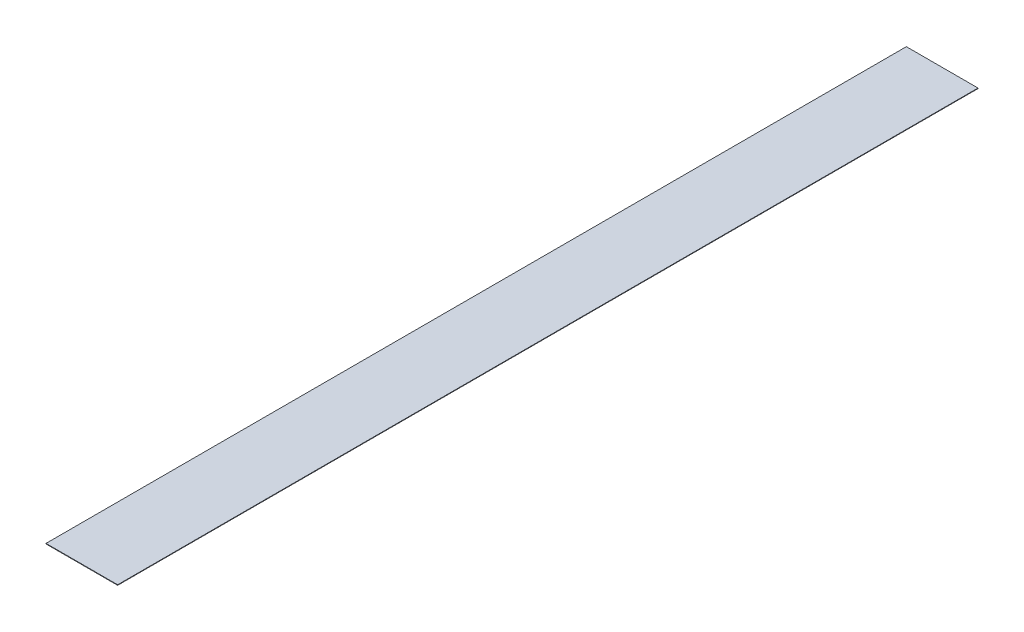
ISO-10303-21;
HEADER;
FILE_DESCRIPTION(('STEP AP214'),'2;1');
FILE_NAME('part.step','',(''),(''),'','','');
FILE_SCHEMA(('AUTOMOTIVE_DESIGN { 1 0 10303 214 1 1 1 1 }'));
ENDSEC;
DATA;
#1=APPLICATION_CONTEXT('core data for automotive mechanical design processes');
#2=APPLICATION_PROTOCOL_DEFINITION('international standard','automotive_design',2000,#1);
#3=PRODUCT_CONTEXT('',#1,'mechanical');
#4=PRODUCT('Part','Part','',(#3));
#5=PRODUCT_RELATED_PRODUCT_CATEGORY('part','',(#4));
#6=PRODUCT_DEFINITION_FORMATION('','',#4);
#7=PRODUCT_DEFINITION_CONTEXT('part definition',#1,'design');
#8=PRODUCT_DEFINITION('design','',#6,#7);
#9=PRODUCT_DEFINITION_SHAPE('','',#8);
#10=(LENGTH_UNIT() NAMED_UNIT(*) SI_UNIT(.MILLI.,.METRE.));
#11=(NAMED_UNIT(*) PLANE_ANGLE_UNIT() SI_UNIT($,.RADIAN.));
#12=(NAMED_UNIT(*) SI_UNIT($,.STERADIAN.) SOLID_ANGLE_UNIT());
#13=UNCERTAINTY_MEASURE_WITH_UNIT(LENGTH_MEASURE(1.E-05),#10,'distance_accuracy_value','');
#14=(GEOMETRIC_REPRESENTATION_CONTEXT(3) GLOBAL_UNCERTAINTY_ASSIGNED_CONTEXT((#13)) GLOBAL_UNIT_ASSIGNED_CONTEXT((#10,
#11,#12)) REPRESENTATION_CONTEXT('',''));
#15=CARTESIAN_POINT('',(0.,0.,0.));
#16=DIRECTION('',(0.,0.,1.));
#17=DIRECTION('',(1.,0.,0.));
#18=AXIS2_PLACEMENT_3D('',#15,#16,#17);
#19=CARTESIAN_POINT('',(-12.45,0.175,-149.5));
#20=DIRECTION('',(1.,0.,0.));
#21=DIRECTION('',(0.,0.,-1.));
#22=AXIS2_PLACEMENT_3D('',#19,#20,#21);
#23=PLANE('',#22);
#24=DIRECTION('',(0.,0.,1.));
#25=VECTOR('',#24,1.);
#26=CARTESIAN_POINT('',(-12.45,0.,-149.5));
#27=LINE('',#26,#25);
#28=CARTESIAN_POINT('',(-12.45,0.,-149.5));
#29=VERTEX_POINT('',#28);
#30=CARTESIAN_POINT('',(-12.45,0.,149.5));
#31=VERTEX_POINT('',#30);
#32=EDGE_CURVE('E97',#29,#31,#27,.T.);
#33=ORIENTED_EDGE('',*,*,#32,.T.);
#34=DIRECTION('',(0.,-1.,0.));
#35=VECTOR('',#34,1.);
#36=CARTESIAN_POINT('',(-12.45,0.175,149.5));
#37=LINE('',#36,#35);
#38=CARTESIAN_POINT('',(-12.45,0.175,149.5));
#39=VERTEX_POINT('',#38);
#40=EDGE_CURVE('E11',#39,#31,#37,.T.);
#41=ORIENTED_EDGE('',*,*,#40,.F.);
#42=DIRECTION('',(0.,0.,1.));
#43=VECTOR('',#42,1.);
#44=CARTESIAN_POINT('',(-12.45,0.175,-149.5));
#45=LINE('',#44,#43);
#46=CARTESIAN_POINT('',(-12.45,0.175,-149.5));
#47=VERTEX_POINT('',#46);
#48=EDGE_CURVE('E85',#47,#39,#45,.T.);
#49=ORIENTED_EDGE('',*,*,#48,.F.);
#50=DIRECTION('',(0.,-1.,0.));
#51=VECTOR('',#50,1.);
#52=CARTESIAN_POINT('',(-12.45,0.175,-149.5));
#53=LINE('',#52,#51);
#54=EDGE_CURVE('E93',#47,#29,#53,.T.);
#55=ORIENTED_EDGE('',*,*,#54,.T.);
#56=EDGE_LOOP('',(#33,#41,#49,#55));
#57=FACE_BOUND('',#56,.T.);
#58=ADVANCED_FACE('F34',(#57),#23,.F.);
#59=CARTESIAN_POINT('',(-12.45,0.175,149.5));
#60=DIRECTION('',(0.,0.,-1.));
#61=DIRECTION('',(-1.,0.,0.));
#62=AXIS2_PLACEMENT_3D('',#59,#60,#61);
#63=PLANE('',#62);
#64=DIRECTION('',(1.,0.,0.));
#65=VECTOR('',#64,1.);
#66=CARTESIAN_POINT('',(-12.45,0.,149.5));
#67=LINE('',#66,#65);
#68=CARTESIAN_POINT('',(12.45,0.,149.5));
#69=VERTEX_POINT('',#68);
#70=EDGE_CURVE('E89',#31,#69,#67,.T.);
#71=ORIENTED_EDGE('',*,*,#70,.T.);
#72=DIRECTION('',(0.,-1.,0.));
#73=VECTOR('',#72,1.);
#74=CARTESIAN_POINT('',(12.45,0.175,149.5));
#75=LINE('',#74,#73);
#76=CARTESIAN_POINT('',(12.45,0.175,149.5));
#77=VERTEX_POINT('',#76);
#78=EDGE_CURVE('E42',#77,#69,#75,.T.);
#79=ORIENTED_EDGE('',*,*,#78,.F.);
#80=DIRECTION('',(1.,0.,0.));
#81=VECTOR('',#80,1.);
#82=CARTESIAN_POINT('',(-12.45,0.175,149.5));
#83=LINE('',#82,#81);
#84=EDGE_CURVE('E80',#39,#77,#83,.T.);
#85=ORIENTED_EDGE('',*,*,#84,.F.);
#86=ORIENTED_EDGE('',*,*,#40,.T.);
#87=EDGE_LOOP('',(#71,#79,#85,#86));
#88=FACE_BOUND('',#87,.T.);
#89=ADVANCED_FACE('F88',(#88),#63,.F.);
#90=CARTESIAN_POINT('',(12.45,0.175,-149.5));
#91=DIRECTION('',(-1.,0.,0.));
#92=DIRECTION('',(0.,0.,1.));
#93=AXIS2_PLACEMENT_3D('',#90,#91,#92);
#94=PLANE('',#93);
#95=DIRECTION('',(0.,0.,-1.));
#96=VECTOR('',#95,1.);
#97=CARTESIAN_POINT('',(12.45,0.,-149.5));
#98=LINE('',#97,#96);
#99=CARTESIAN_POINT('',(12.45,0.,-149.5));
#100=VERTEX_POINT('',#99);
#101=EDGE_CURVE('E67',#69,#100,#98,.T.);
#102=ORIENTED_EDGE('',*,*,#101,.T.);
#103=DIRECTION('',(0.,-1.,0.));
#104=VECTOR('',#103,1.);
#105=CARTESIAN_POINT('',(12.45,0.175,-149.5));
#106=LINE('',#105,#104);
#107=CARTESIAN_POINT('',(12.45,0.175,-149.5));
#108=VERTEX_POINT('',#107);
#109=EDGE_CURVE('E90',#108,#100,#106,.T.);
#110=ORIENTED_EDGE('',*,*,#109,.F.);
#111=DIRECTION('',(0.,0.,-1.));
#112=VECTOR('',#111,1.);
#113=CARTESIAN_POINT('',(12.45,0.175,-149.5));
#114=LINE('',#113,#112);
#115=EDGE_CURVE('E83',#77,#108,#114,.T.);
#116=ORIENTED_EDGE('',*,*,#115,.F.);
#117=ORIENTED_EDGE('',*,*,#78,.T.);
#118=EDGE_LOOP('',(#102,#110,#116,#117));
#119=FACE_BOUND('',#118,.T.);
#120=ADVANCED_FACE('F91',(#119),#94,.F.);
#121=CARTESIAN_POINT('',(-12.45,0.175,-149.5));
#122=DIRECTION('',(0.,0.,1.));
#123=DIRECTION('',(1.,0.,0.));
#124=AXIS2_PLACEMENT_3D('',#121,#122,#123);
#125=PLANE('',#124);
#126=DIRECTION('',(-1.,0.,0.));
#127=VECTOR('',#126,1.);
#128=CARTESIAN_POINT('',(-12.45,0.,-149.5));
#129=LINE('',#128,#127);
#130=EDGE_CURVE('E73',#100,#29,#129,.T.);
#131=ORIENTED_EDGE('',*,*,#130,.T.);
#132=ORIENTED_EDGE('',*,*,#54,.F.);
#133=DIRECTION('',(-1.,0.,0.));
#134=VECTOR('',#133,1.);
#135=CARTESIAN_POINT('',(-12.45,0.175,-149.5));
#136=LINE('',#135,#134);
#137=EDGE_CURVE('E50',#108,#47,#136,.T.);
#138=ORIENTED_EDGE('',*,*,#137,.F.);
#139=ORIENTED_EDGE('',*,*,#109,.T.);
#140=EDGE_LOOP('',(#131,#132,#138,#139));
#141=FACE_BOUND('',#140,.T.);
#142=ADVANCED_FACE('F104',(#141),#125,.F.);
#143=CARTESIAN_POINT('',(-12.45,0.175,149.5));
#144=DIRECTION('',(0.,1.,0.));
#145=DIRECTION('',(0.,0.,1.));
#146=AXIS2_PLACEMENT_3D('',#143,#144,#145);
#147=PLANE('',#146);
#148=ORIENTED_EDGE('',*,*,#48,.T.);
#149=ORIENTED_EDGE('',*,*,#84,.T.);
#150=ORIENTED_EDGE('',*,*,#115,.T.);
#151=ORIENTED_EDGE('',*,*,#137,.T.);
#152=EDGE_LOOP('',(#148,#149,#150,#151));
#153=FACE_BOUND('',#152,.T.);
#154=ADVANCED_FACE('F81',(#153),#147,.T.);
#155=CARTESIAN_POINT('',(-12.45,0.,149.5));
#156=DIRECTION('',(0.,1.,0.));
#157=DIRECTION('',(0.,0.,1.));
#158=AXIS2_PLACEMENT_3D('',#155,#156,#157);
#159=PLANE('',#158);
#160=ORIENTED_EDGE('',*,*,#32,.F.);
#161=ORIENTED_EDGE('',*,*,#130,.F.);
#162=ORIENTED_EDGE('',*,*,#101,.F.);
#163=ORIENTED_EDGE('',*,*,#70,.F.);
#164=EDGE_LOOP('',(#160,#161,#162,#163));
#165=FACE_BOUND('',#164,.T.);
#166=ADVANCED_FACE('F107',(#165),#159,.F.);
#167=CLOSED_SHELL('',(#58,#89,#120,#142,#154,#166));
#168=MANIFOLD_SOLID_BREP('B2',#167);
#169=ADVANCED_BREP_SHAPE_REPRESENTATION('',(#18,#168),#14);
#170=SHAPE_DEFINITION_REPRESENTATION(#9,#169);
ENDSEC;
END-ISO-10303-21;
